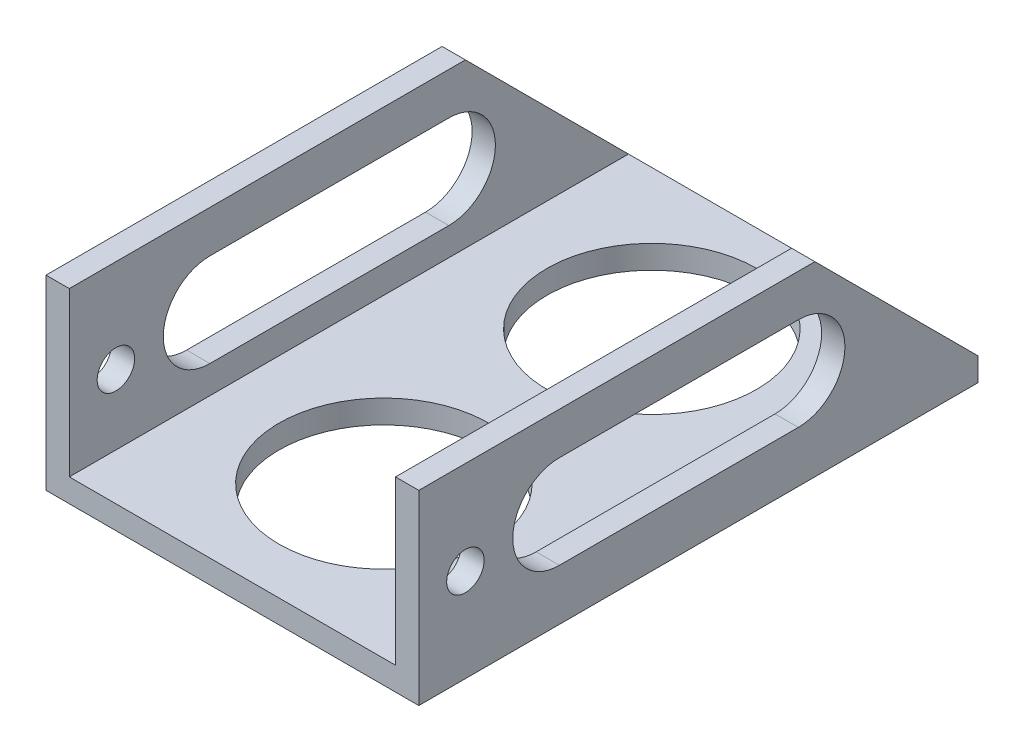
ISO-10303-21;
HEADER;
FILE_DESCRIPTION(('STEP AP214'),'2;1');
FILE_NAME('part.step','',(''),(''),'','','');
FILE_SCHEMA(('AUTOMOTIVE_DESIGN { 1 0 10303 214 1 1 1 1 }'));
ENDSEC;
DATA;
#1=APPLICATION_CONTEXT('core data for automotive mechanical design processes');
#2=APPLICATION_PROTOCOL_DEFINITION('international standard','automotive_design',2000,#1);
#3=PRODUCT_CONTEXT('',#1,'mechanical');
#4=PRODUCT('Part','Part','',(#3));
#5=PRODUCT_RELATED_PRODUCT_CATEGORY('part','',(#4));
#6=PRODUCT_DEFINITION_FORMATION('','',#4);
#7=PRODUCT_DEFINITION_CONTEXT('part definition',#1,'design');
#8=PRODUCT_DEFINITION('design','',#6,#7);
#9=PRODUCT_DEFINITION_SHAPE('','',#8);
#10=(LENGTH_UNIT() NAMED_UNIT(*) SI_UNIT(.MILLI.,.METRE.));
#11=(NAMED_UNIT(*) PLANE_ANGLE_UNIT() SI_UNIT($,.RADIAN.));
#12=(NAMED_UNIT(*) SI_UNIT($,.STERADIAN.) SOLID_ANGLE_UNIT());
#13=UNCERTAINTY_MEASURE_WITH_UNIT(LENGTH_MEASURE(1.E-05),#10,'distance_accuracy_value','');
#14=(GEOMETRIC_REPRESENTATION_CONTEXT(3) GLOBAL_UNCERTAINTY_ASSIGNED_CONTEXT((#13)) GLOBAL_UNIT_ASSIGNED_CONTEXT((#10,
#11,#12)) REPRESENTATION_CONTEXT('',''));
#15=CARTESIAN_POINT('',(0.,0.,0.));
#16=DIRECTION('',(0.,0.,1.));
#17=DIRECTION('',(1.,0.,0.));
#18=AXIS2_PLACEMENT_3D('',#15,#16,#17);
#19=CARTESIAN_POINT('',(0.,0.,76.2));
#20=DIRECTION('',(1.,0.,0.));
#21=DIRECTION('',(0.,0.,-1.));
#22=AXIS2_PLACEMENT_3D('',#19,#20,#21);
#23=PLANE('',#22);
#24=DIRECTION('',(0.,0.,1.));
#25=VECTOR('',#24,1.);
#26=CARTESIAN_POINT('',(0.,6.97375743317016,24.4858929425078));
#27=LINE('',#26,#25);
#28=CARTESIAN_POINT('',(0.,6.97375743317016,24.4858929425078));
#29=VERTEX_POINT('',#28);
#30=CARTESIAN_POINT('',(0.,6.97375743317016,57.0401023301699));
#31=VERTEX_POINT('',#30);
#32=EDGE_CURVE('E173',#29,#31,#27,.T.);
#33=ORIENTED_EDGE('',*,*,#32,.F.);
#34=CARTESIAN_POINT('',(0.,13.3237574331702,24.4858929425078));
#35=DIRECTION('',(-1.,0.,0.));
#36=DIRECTION('',(0.,0.,1.));
#37=AXIS2_PLACEMENT_3D('',#34,#35,#36);
#38=CIRCLE('',#37,6.35);
#39=CARTESIAN_POINT('',(0.,19.6737574331702,24.4858929425078));
#40=VERTEX_POINT('',#39);
#41=EDGE_CURVE('E52',#40,#29,#38,.T.);
#42=ORIENTED_EDGE('',*,*,#41,.F.);
#43=DIRECTION('',(0.,0.,-1.));
#44=VECTOR('',#43,1.);
#45=CARTESIAN_POINT('',(0.,19.6737574331702,24.4858929425078));
#46=LINE('',#45,#44);
#47=CARTESIAN_POINT('',(0.,19.6737574331702,57.0401023301699));
#48=VERTEX_POINT('',#47);
#49=EDGE_CURVE('E180',#48,#40,#46,.T.);
#50=ORIENTED_EDGE('',*,*,#49,.F.);
#51=CARTESIAN_POINT('',(0.,13.3237574331702,57.0401023301699));
#52=DIRECTION('',(-1.,0.,0.));
#53=DIRECTION('',(0.,0.,1.));
#54=AXIS2_PLACEMENT_3D('',#51,#52,#53);
#55=CIRCLE('',#54,6.35);
#56=EDGE_CURVE('E163',#31,#48,#55,.T.);
#57=ORIENTED_EDGE('',*,*,#56,.F.);
#58=EDGE_LOOP('',(#33,#42,#50,#57));
#59=FACE_BOUND('',#58,.T.);
#60=CARTESIAN_POINT('',(0.,12.7,69.85));
#61=DIRECTION('',(-1.,0.,0.));
#62=DIRECTION('',(0.,0.,1.));
#63=AXIS2_PLACEMENT_3D('',#60,#61,#62);
#64=CIRCLE('',#63,2.5527);
#65=CARTESIAN_POINT('',(0.,12.7,72.4027));
#66=VERTEX_POINT('',#65);
#67=EDGE_CURVE('E239',#66,#66,#64,.T.);
#68=ORIENTED_EDGE('',*,*,#67,.F.);
#69=EDGE_LOOP('',(#68));
#70=FACE_BOUND('',#69,.T.);
#71=DIRECTION('',(0.,0.,-1.));
#72=VECTOR('',#71,1.);
#73=CARTESIAN_POINT('',(0.,25.4,76.2));
#74=LINE('',#73,#72);
#75=CARTESIAN_POINT('',(0.,25.4,76.2));
#76=VERTEX_POINT('',#75);
#77=CARTESIAN_POINT('',(0.,25.4,22.2249999999997));
#78=VERTEX_POINT('',#77);
#79=EDGE_CURVE('E274',#76,#78,#74,.T.);
#80=ORIENTED_EDGE('',*,*,#79,.T.);
#81=DIRECTION('',(0.,0.707106781186552,0.707106781186543));
#82=VECTOR('',#81,1.);
#83=CARTESIAN_POINT('',(0.,3.175,0.));
#84=LINE('',#83,#82);
#85=CARTESIAN_POINT('',(0.,3.175,0.));
#86=VERTEX_POINT('',#85);
#87=EDGE_CURVE('E222',#86,#78,#84,.T.);
#88=ORIENTED_EDGE('',*,*,#87,.F.);
#89=DIRECTION('',(0.,-1.,0.));
#90=VECTOR('',#89,1.);
#91=CARTESIAN_POINT('',(0.,0.,0.));
#92=LINE('',#91,#90);
#93=CARTESIAN_POINT('',(0.,0.,0.));
#94=VERTEX_POINT('',#93);
#95=EDGE_CURVE('E255',#86,#94,#92,.T.);
#96=ORIENTED_EDGE('',*,*,#95,.T.);
#97=DIRECTION('',(0.,0.,-1.));
#98=VECTOR('',#97,1.);
#99=CARTESIAN_POINT('',(0.,0.,76.2));
#100=LINE('',#99,#98);
#101=CARTESIAN_POINT('',(0.,0.,76.2));
#102=VERTEX_POINT('',#101);
#103=EDGE_CURVE('E303',#102,#94,#100,.T.);
#104=ORIENTED_EDGE('',*,*,#103,.F.);
#105=DIRECTION('',(0.,-1.,0.));
#106=VECTOR('',#105,1.);
#107=CARTESIAN_POINT('',(0.,0.,76.2));
#108=LINE('',#107,#106);
#109=EDGE_CURVE('E256',#76,#102,#108,.T.);
#110=ORIENTED_EDGE('',*,*,#109,.F.);
#111=EDGE_LOOP('',(#80,#88,#96,#104,#110));
#112=FACE_BOUND('',#111,.T.);
#113=ADVANCED_FACE('F38',(#59,#70,#112),#23,.F.);
#114=CARTESIAN_POINT('',(0.,0.,76.2));
#115=DIRECTION('',(0.,1.,0.));
#116=DIRECTION('',(0.,0.,1.));
#117=AXIS2_PLACEMENT_3D('',#114,#115,#116);
#118=PLANE('',#117);
#119=CARTESIAN_POINT('',(25.4,0.,55.5625));
#120=DIRECTION('',(0.,1.,0.));
#121=DIRECTION('',(0.,0.,1.));
#122=AXIS2_PLACEMENT_3D('',#119,#120,#121);
#123=CIRCLE('',#122,14.2875);
#124=CARTESIAN_POINT('',(25.4,0.,69.85));
#125=VERTEX_POINT('',#124);
#126=EDGE_CURVE('E219',#125,#125,#123,.F.);
#127=ORIENTED_EDGE('',*,*,#126,.F.);
#128=EDGE_LOOP('',(#127));
#129=FACE_BOUND('',#128,.T.);
#130=CARTESIAN_POINT('',(25.4,0.,19.05));
#131=DIRECTION('',(0.,-1.,0.));
#132=DIRECTION('',(0.,0.,-1.));
#133=AXIS2_PLACEMENT_3D('',#130,#131,#132);
#134=CIRCLE('',#133,14.2875);
#135=CARTESIAN_POINT('',(25.4,0.,4.7625));
#136=VERTEX_POINT('',#135);
#137=EDGE_CURVE('E249',#136,#136,#134,.T.);
#138=ORIENTED_EDGE('',*,*,#137,.F.);
#139=EDGE_LOOP('',(#138));
#140=FACE_BOUND('',#139,.T.);
#141=DIRECTION('',(1.,0.,0.));
#142=VECTOR('',#141,1.);
#143=CARTESIAN_POINT('',(0.,0.,0.));
#144=LINE('',#143,#142);
#145=CARTESIAN_POINT('',(50.8,0.,0.));
#146=VERTEX_POINT('',#145);
#147=EDGE_CURVE('E276',#94,#146,#144,.T.);
#148=ORIENTED_EDGE('',*,*,#147,.T.);
#149=DIRECTION('',(0.,0.,-1.));
#150=VECTOR('',#149,1.);
#151=CARTESIAN_POINT('',(50.8,0.,76.2));
#152=LINE('',#151,#150);
#153=CARTESIAN_POINT('',(50.8,0.,76.2));
#154=VERTEX_POINT('',#153);
#155=EDGE_CURVE('E300',#154,#146,#152,.T.);
#156=ORIENTED_EDGE('',*,*,#155,.F.);
#157=DIRECTION('',(1.,0.,0.));
#158=VECTOR('',#157,1.);
#159=CARTESIAN_POINT('',(0.,0.,76.2));
#160=LINE('',#159,#158);
#161=EDGE_CURVE('E259',#102,#154,#160,.T.);
#162=ORIENTED_EDGE('',*,*,#161,.F.);
#163=ORIENTED_EDGE('',*,*,#103,.T.);
#164=EDGE_LOOP('',(#148,#156,#162,#163));
#165=FACE_BOUND('',#164,.T.);
#166=ADVANCED_FACE('F333',(#129,#140,#165),#118,.F.);
#167=CARTESIAN_POINT('',(50.8,0.,76.2));
#168=DIRECTION('',(-1.,0.,0.));
#169=DIRECTION('',(0.,0.,1.));
#170=AXIS2_PLACEMENT_3D('',#167,#168,#169);
#171=PLANE('',#170);
#172=DIRECTION('',(0.,0.,-1.));
#173=VECTOR('',#172,1.);
#174=CARTESIAN_POINT('',(50.8,19.6737574331702,24.4858929425078));
#175=LINE('',#174,#173);
#176=CARTESIAN_POINT('',(50.8,19.6737574331702,57.0401023301699));
#177=VERTEX_POINT('',#176);
#178=CARTESIAN_POINT('',(50.8,19.6737574331702,24.4858929425078));
#179=VERTEX_POINT('',#178);
#180=EDGE_CURVE('E192',#177,#179,#175,.T.);
#181=ORIENTED_EDGE('',*,*,#180,.T.);
#182=CARTESIAN_POINT('',(50.8,13.3237574331702,24.4858929425078));
#183=DIRECTION('',(-1.,0.,0.));
#184=DIRECTION('',(0.,0.,1.));
#185=AXIS2_PLACEMENT_3D('',#182,#183,#184);
#186=CIRCLE('',#185,6.35);
#187=CARTESIAN_POINT('',(50.8,6.97375743317016,24.4858929425078));
#188=VERTEX_POINT('',#187);
#189=EDGE_CURVE('E182',#179,#188,#186,.T.);
#190=ORIENTED_EDGE('',*,*,#189,.T.);
#191=DIRECTION('',(0.,0.,1.));
#192=VECTOR('',#191,1.);
#193=CARTESIAN_POINT('',(50.8,6.97375743317016,24.4858929425078));
#194=LINE('',#193,#192);
#195=CARTESIAN_POINT('',(50.8,6.97375743317016,57.0401023301699));
#196=VERTEX_POINT('',#195);
#197=EDGE_CURVE('E188',#188,#196,#194,.T.);
#198=ORIENTED_EDGE('',*,*,#197,.T.);
#199=CARTESIAN_POINT('',(50.8,13.3237574331702,57.0401023301699));
#200=DIRECTION('',(-1.,0.,0.));
#201=DIRECTION('',(0.,0.,1.));
#202=AXIS2_PLACEMENT_3D('',#199,#200,#201);
#203=CIRCLE('',#202,6.35);
#204=EDGE_CURVE('E60',#196,#177,#203,.T.);
#205=ORIENTED_EDGE('',*,*,#204,.T.);
#206=EDGE_LOOP('',(#181,#190,#198,#205));
#207=FACE_BOUND('',#206,.T.);
#208=CARTESIAN_POINT('',(50.8,12.7,69.85));
#209=DIRECTION('',(-1.,0.,0.));
#210=DIRECTION('',(0.,0.,1.));
#211=AXIS2_PLACEMENT_3D('',#208,#209,#210);
#212=CIRCLE('',#211,2.5527);
#213=CARTESIAN_POINT('',(50.8,12.7,72.4027));
#214=VERTEX_POINT('',#213);
#215=EDGE_CURVE('E240',#214,#214,#212,.T.);
#216=ORIENTED_EDGE('',*,*,#215,.T.);
#217=EDGE_LOOP('',(#216));
#218=FACE_BOUND('',#217,.T.);
#219=DIRECTION('',(0.,1.,0.));
#220=VECTOR('',#219,1.);
#221=CARTESIAN_POINT('',(50.8,0.,0.));
#222=LINE('',#221,#220);
#223=CARTESIAN_POINT('',(50.8,3.175,0.));
#224=VERTEX_POINT('',#223);
#225=EDGE_CURVE('E278',#146,#224,#222,.T.);
#226=ORIENTED_EDGE('',*,*,#225,.T.);
#227=DIRECTION('',(0.,0.707106781186552,0.707106781186543));
#228=VECTOR('',#227,1.);
#229=CARTESIAN_POINT('',(50.8,3.175,0.));
#230=LINE('',#229,#228);
#231=CARTESIAN_POINT('',(50.8,25.4,22.2249999999997));
#232=VERTEX_POINT('',#231);
#233=EDGE_CURVE('E224',#224,#232,#230,.T.);
#234=ORIENTED_EDGE('',*,*,#233,.T.);
#235=DIRECTION('',(0.,0.,-1.));
#236=VECTOR('',#235,1.);
#237=CARTESIAN_POINT('',(50.8,25.4,76.2));
#238=LINE('',#237,#236);
#239=CARTESIAN_POINT('',(50.8,25.4,76.2));
#240=VERTEX_POINT('',#239);
#241=EDGE_CURVE('E297',#240,#232,#238,.T.);
#242=ORIENTED_EDGE('',*,*,#241,.F.);
#243=DIRECTION('',(0.,1.,0.));
#244=VECTOR('',#243,1.);
#245=CARTESIAN_POINT('',(50.8,0.,76.2));
#246=LINE('',#245,#244);
#247=EDGE_CURVE('E262',#154,#240,#246,.T.);
#248=ORIENTED_EDGE('',*,*,#247,.F.);
#249=ORIENTED_EDGE('',*,*,#155,.T.);
#250=EDGE_LOOP('',(#226,#234,#242,#248,#249));
#251=FACE_BOUND('',#250,.T.);
#252=ADVANCED_FACE('F337',(#207,#218,#251),#171,.F.);
#253=CARTESIAN_POINT('',(50.8,25.4,76.2));
#254=DIRECTION('',(0.,-1.,0.));
#255=DIRECTION('',(0.,0.,-1.));
#256=AXIS2_PLACEMENT_3D('',#253,#254,#255);
#257=PLANE('',#256);
#258=ORIENTED_EDGE('',*,*,#241,.T.);
#259=DIRECTION('',(-1.,0.,0.));
#260=VECTOR('',#259,1.);
#261=CARTESIAN_POINT('',(50.8,25.4,22.2249999999997));
#262=LINE('',#261,#260);
#263=CARTESIAN_POINT('',(47.625,25.4,22.2249999999997));
#264=VERTEX_POINT('',#263);
#265=EDGE_CURVE('E228',#232,#264,#262,.T.);
#266=ORIENTED_EDGE('',*,*,#265,.T.);
#267=DIRECTION('',(0.,0.,-1.));
#268=VECTOR('',#267,1.);
#269=CARTESIAN_POINT('',(47.625,25.4,76.2));
#270=LINE('',#269,#268);
#271=CARTESIAN_POINT('',(47.625,25.4,76.2));
#272=VERTEX_POINT('',#271);
#273=EDGE_CURVE('E294',#272,#264,#270,.T.);
#274=ORIENTED_EDGE('',*,*,#273,.F.);
#275=DIRECTION('',(-1.,0.,0.));
#276=VECTOR('',#275,1.);
#277=CARTESIAN_POINT('',(50.8,25.4,76.2));
#278=LINE('',#277,#276);
#279=EDGE_CURVE('E264',#240,#272,#278,.T.);
#280=ORIENTED_EDGE('',*,*,#279,.F.);
#281=EDGE_LOOP('',(#258,#266,#274,#280));
#282=FACE_BOUND('',#281,.T.);
#283=ADVANCED_FACE('F342',(#282),#257,.F.);
#284=CARTESIAN_POINT('',(47.625,3.175,76.2));
#285=DIRECTION('',(1.,0.,0.));
#286=DIRECTION('',(0.,0.,-1.));
#287=AXIS2_PLACEMENT_3D('',#284,#285,#286);
#288=PLANE('',#287);
#289=DIRECTION('',(0.,0.,-1.));
#290=VECTOR('',#289,1.);
#291=CARTESIAN_POINT('',(47.625,6.97375743317016,76.2));
#292=LINE('',#291,#290);
#293=CARTESIAN_POINT('',(47.625,6.97375743317016,57.0401023301699));
#294=VERTEX_POINT('',#293);
#295=CARTESIAN_POINT('',(47.625,6.97375743317016,24.4858929425078));
#296=VERTEX_POINT('',#295);
#297=EDGE_CURVE('E198',#294,#296,#292,.T.);
#298=ORIENTED_EDGE('',*,*,#297,.T.);
#299=CARTESIAN_POINT('',(47.625,13.3237574331702,24.4858929425078));
#300=DIRECTION('',(1.,0.,0.));
#301=DIRECTION('',(0.,0.,-1.));
#302=AXIS2_PLACEMENT_3D('',#299,#300,#301);
#303=CIRCLE('',#302,6.35);
#304=CARTESIAN_POINT('',(47.625,19.6737574331702,24.4858929425078));
#305=VERTEX_POINT('',#304);
#306=EDGE_CURVE('E213',#296,#305,#303,.T.);
#307=ORIENTED_EDGE('',*,*,#306,.T.);
#308=DIRECTION('',(0.,0.,1.));
#309=VECTOR('',#308,1.);
#310=CARTESIAN_POINT('',(47.625,19.6737574331702,76.2));
#311=LINE('',#310,#309);
#312=CARTESIAN_POINT('',(47.625,19.6737574331702,57.0401023301699));
#313=VERTEX_POINT('',#312);
#314=EDGE_CURVE('E210',#305,#313,#311,.T.);
#315=ORIENTED_EDGE('',*,*,#314,.T.);
#316=CARTESIAN_POINT('',(47.625,13.3237574331702,57.0401023301699));
#317=DIRECTION('',(1.,0.,0.));
#318=DIRECTION('',(0.,0.,-1.));
#319=AXIS2_PLACEMENT_3D('',#316,#317,#318);
#320=CIRCLE('',#319,6.35);
#321=EDGE_CURVE('E207',#313,#294,#320,.T.);
#322=ORIENTED_EDGE('',*,*,#321,.T.);
#323=EDGE_LOOP('',(#298,#307,#315,#322));
#324=FACE_BOUND('',#323,.T.);
#325=CARTESIAN_POINT('',(47.625,12.7,69.85));
#326=DIRECTION('',(1.,0.,0.));
#327=DIRECTION('',(0.,0.,-1.));
#328=AXIS2_PLACEMENT_3D('',#325,#326,#327);
#329=CIRCLE('',#328,2.5527);
#330=CARTESIAN_POINT('',(47.625,12.7,67.2973));
#331=VERTEX_POINT('',#330);
#332=EDGE_CURVE('E246',#331,#331,#329,.T.);
#333=ORIENTED_EDGE('',*,*,#332,.T.);
#334=EDGE_LOOP('',(#333));
#335=FACE_BOUND('',#334,.T.);
#336=ORIENTED_EDGE('',*,*,#273,.T.);
#337=DIRECTION('',(0.,-0.707106781186552,-0.707106781186543));
#338=VECTOR('',#337,1.);
#339=CARTESIAN_POINT('',(47.625,41.275,38.0999999999996));
#340=LINE('',#339,#338);
#341=CARTESIAN_POINT('',(47.625,3.175,0.));
#342=VERTEX_POINT('',#341);
#343=EDGE_CURVE('E236',#264,#342,#340,.T.);
#344=ORIENTED_EDGE('',*,*,#343,.T.);
#345=DIRECTION('',(0.,0.,-1.));
#346=VECTOR('',#345,1.);
#347=CARTESIAN_POINT('',(47.625,3.175,76.2));
#348=LINE('',#347,#346);
#349=CARTESIAN_POINT('',(47.625,3.175,76.2));
#350=VERTEX_POINT('',#349);
#351=EDGE_CURVE('E291',#350,#342,#348,.T.);
#352=ORIENTED_EDGE('',*,*,#351,.F.);
#353=DIRECTION('',(0.,-1.,0.));
#354=VECTOR('',#353,1.);
#355=CARTESIAN_POINT('',(47.625,3.175,76.2));
#356=LINE('',#355,#354);
#357=EDGE_CURVE('E266',#272,#350,#356,.T.);
#358=ORIENTED_EDGE('',*,*,#357,.F.);
#359=EDGE_LOOP('',(#336,#344,#352,#358));
#360=FACE_BOUND('',#359,.T.);
#361=ADVANCED_FACE('F350',(#324,#335,#360),#288,.F.);
#362=CARTESIAN_POINT('',(3.175,3.175,76.2));
#363=DIRECTION('',(0.,-1.,0.));
#364=DIRECTION('',(0.,0.,-1.));
#365=AXIS2_PLACEMENT_3D('',#362,#363,#364);
#366=PLANE('',#365);
#367=CARTESIAN_POINT('',(25.4,3.175,55.5625));
#368=DIRECTION('',(0.,1.,0.));
#369=DIRECTION('',(0.,0.,1.));
#370=AXIS2_PLACEMENT_3D('',#367,#368,#369);
#371=CIRCLE('',#370,14.2875);
#372=CARTESIAN_POINT('',(25.4,3.175,69.85));
#373=VERTEX_POINT('',#372);
#374=EDGE_CURVE('E216',#373,#373,#371,.T.);
#375=ORIENTED_EDGE('',*,*,#374,.F.);
#376=EDGE_LOOP('',(#375));
#377=FACE_BOUND('',#376,.T.);
#378=CARTESIAN_POINT('',(25.4,3.175,19.05));
#379=DIRECTION('',(0.,-1.,0.));
#380=DIRECTION('',(0.,0.,-1.));
#381=AXIS2_PLACEMENT_3D('',#378,#379,#380);
#382=CIRCLE('',#381,14.2875);
#383=CARTESIAN_POINT('',(25.4,3.175,4.7625));
#384=VERTEX_POINT('',#383);
#385=EDGE_CURVE('E252',#384,#384,#382,.F.);
#386=ORIENTED_EDGE('',*,*,#385,.F.);
#387=EDGE_LOOP('',(#386));
#388=FACE_BOUND('',#387,.T.);
#389=DIRECTION('',(-1.,0.,0.));
#390=VECTOR('',#389,1.);
#391=CARTESIAN_POINT('',(3.175,3.175,0.));
#392=LINE('',#391,#390);
#393=CARTESIAN_POINT('',(3.175,3.175,0.));
#394=VERTEX_POINT('',#393);
#395=EDGE_CURVE('E260',#342,#394,#392,.T.);
#396=ORIENTED_EDGE('',*,*,#395,.T.);
#397=DIRECTION('',(0.,0.,-1.));
#398=VECTOR('',#397,1.);
#399=CARTESIAN_POINT('',(3.175,3.175,76.2));
#400=LINE('',#399,#398);
#401=CARTESIAN_POINT('',(3.175,3.175,76.2));
#402=VERTEX_POINT('',#401);
#403=EDGE_CURVE('E288',#402,#394,#400,.T.);
#404=ORIENTED_EDGE('',*,*,#403,.F.);
#405=DIRECTION('',(-1.,0.,0.));
#406=VECTOR('',#405,1.);
#407=CARTESIAN_POINT('',(3.175,3.175,76.2));
#408=LINE('',#407,#406);
#409=EDGE_CURVE('E268',#350,#402,#408,.T.);
#410=ORIENTED_EDGE('',*,*,#409,.F.);
#411=ORIENTED_EDGE('',*,*,#351,.T.);
#412=EDGE_LOOP('',(#396,#404,#410,#411));
#413=FACE_BOUND('',#412,.T.);
#414=ADVANCED_FACE('F354',(#377,#388,#413),#366,.F.);
#415=CARTESIAN_POINT('',(3.175,3.175,76.2));
#416=DIRECTION('',(-1.,0.,0.));
#417=DIRECTION('',(0.,0.,1.));
#418=AXIS2_PLACEMENT_3D('',#415,#416,#417);
#419=PLANE('',#418);
#420=DIRECTION('',(0.,0.,-1.));
#421=VECTOR('',#420,1.);
#422=CARTESIAN_POINT('',(3.175,19.6737574331702,76.2));
#423=LINE('',#422,#421);
#424=CARTESIAN_POINT('',(3.175,19.6737574331702,57.0401023301699));
#425=VERTEX_POINT('',#424);
#426=CARTESIAN_POINT('',(3.175,19.6737574331702,24.4858929425078));
#427=VERTEX_POINT('',#426);
#428=EDGE_CURVE('E45',#425,#427,#423,.T.);
#429=ORIENTED_EDGE('',*,*,#428,.T.);
#430=CARTESIAN_POINT('',(3.175,13.3237574331702,24.4858929425078));
#431=DIRECTION('',(-1.,0.,0.));
#432=DIRECTION('',(0.,0.,1.));
#433=AXIS2_PLACEMENT_3D('',#430,#431,#432);
#434=CIRCLE('',#433,6.35);
#435=CARTESIAN_POINT('',(3.175,6.97375743317016,24.4858929425078));
#436=VERTEX_POINT('',#435);
#437=EDGE_CURVE('E11',#427,#436,#434,.T.);
#438=ORIENTED_EDGE('',*,*,#437,.T.);
#439=DIRECTION('',(0.,0.,1.));
#440=VECTOR('',#439,1.);
#441=CARTESIAN_POINT('',(3.175,6.97375743317016,76.2));
#442=LINE('',#441,#440);
#443=CARTESIAN_POINT('',(3.175,6.97375743317016,57.0401023301699));
#444=VERTEX_POINT('',#443);
#445=EDGE_CURVE('E310',#436,#444,#442,.T.);
#446=ORIENTED_EDGE('',*,*,#445,.T.);
#447=CARTESIAN_POINT('',(3.175,13.3237574331702,57.0401023301699));
#448=DIRECTION('',(-1.,0.,0.));
#449=DIRECTION('',(0.,0.,1.));
#450=AXIS2_PLACEMENT_3D('',#447,#448,#449);
#451=CIRCLE('',#450,6.35);
#452=EDGE_CURVE('E166',#444,#425,#451,.T.);
#453=ORIENTED_EDGE('',*,*,#452,.T.);
#454=EDGE_LOOP('',(#429,#438,#446,#453));
#455=FACE_BOUND('',#454,.T.);
#456=CARTESIAN_POINT('',(3.175,12.7,69.85));
#457=DIRECTION('',(-1.,0.,0.));
#458=DIRECTION('',(0.,0.,1.));
#459=AXIS2_PLACEMENT_3D('',#456,#457,#458);
#460=CIRCLE('',#459,2.5527);
#461=CARTESIAN_POINT('',(3.175,12.7,72.4027));
#462=VERTEX_POINT('',#461);
#463=EDGE_CURVE('E243',#462,#462,#460,.T.);
#464=ORIENTED_EDGE('',*,*,#463,.T.);
#465=EDGE_LOOP('',(#464));
#466=FACE_BOUND('',#465,.T.);
#467=ORIENTED_EDGE('',*,*,#403,.T.);
#468=DIRECTION('',(0.,0.707106781186552,0.707106781186543));
#469=VECTOR('',#468,1.);
#470=CARTESIAN_POINT('',(3.175,41.275,38.0999999999996));
#471=LINE('',#470,#469);
#472=CARTESIAN_POINT('',(3.175,25.4,22.2249999999997));
#473=VERTEX_POINT('',#472);
#474=EDGE_CURVE('E231',#394,#473,#471,.T.);
#475=ORIENTED_EDGE('',*,*,#474,.T.);
#476=DIRECTION('',(0.,0.,-1.));
#477=VECTOR('',#476,1.);
#478=CARTESIAN_POINT('',(3.175,25.4,76.2));
#479=LINE('',#478,#477);
#480=CARTESIAN_POINT('',(3.175,25.4,76.2));
#481=VERTEX_POINT('',#480);
#482=EDGE_CURVE('E285',#481,#473,#479,.T.);
#483=ORIENTED_EDGE('',*,*,#482,.F.);
#484=DIRECTION('',(0.,1.,0.));
#485=VECTOR('',#484,1.);
#486=CARTESIAN_POINT('',(3.175,3.175,76.2));
#487=LINE('',#486,#485);
#488=EDGE_CURVE('E270',#402,#481,#487,.T.);
#489=ORIENTED_EDGE('',*,*,#488,.F.);
#490=EDGE_LOOP('',(#467,#475,#483,#489));
#491=FACE_BOUND('',#490,.T.);
#492=ADVANCED_FACE('F314',(#455,#466,#491),#419,.F.);
#493=CARTESIAN_POINT('',(0.,25.4,76.2));
#494=DIRECTION('',(0.,-1.,0.));
#495=DIRECTION('',(0.,0.,-1.));
#496=AXIS2_PLACEMENT_3D('',#493,#494,#495);
#497=PLANE('',#496);
#498=ORIENTED_EDGE('',*,*,#482,.T.);
#499=EDGE_CURVE('E232',#473,#78,#262,.T.);
#500=ORIENTED_EDGE('',*,*,#499,.T.);
#501=ORIENTED_EDGE('',*,*,#79,.F.);
#502=DIRECTION('',(-1.,0.,0.));
#503=VECTOR('',#502,1.);
#504=CARTESIAN_POINT('',(0.,25.4,76.2));
#505=LINE('',#504,#503);
#506=EDGE_CURVE('E272',#481,#76,#505,.T.);
#507=ORIENTED_EDGE('',*,*,#506,.F.);
#508=EDGE_LOOP('',(#498,#500,#501,#507));
#509=FACE_BOUND('',#508,.T.);
#510=ADVANCED_FACE('F361',(#509),#497,.F.);
#511=CARTESIAN_POINT('',(0.,0.,76.2));
#512=DIRECTION('',(0.,0.,-1.));
#513=DIRECTION('',(-1.,0.,0.));
#514=AXIS2_PLACEMENT_3D('',#511,#512,#513);
#515=PLANE('',#514);
#516=ORIENTED_EDGE('',*,*,#109,.T.);
#517=ORIENTED_EDGE('',*,*,#161,.T.);
#518=ORIENTED_EDGE('',*,*,#247,.T.);
#519=ORIENTED_EDGE('',*,*,#279,.T.);
#520=ORIENTED_EDGE('',*,*,#357,.T.);
#521=ORIENTED_EDGE('',*,*,#409,.T.);
#522=ORIENTED_EDGE('',*,*,#488,.T.);
#523=ORIENTED_EDGE('',*,*,#506,.T.);
#524=EDGE_LOOP('',(#516,#517,#518,#519,#520,#521,#522,#523));
#525=FACE_BOUND('',#524,.T.);
#526=ADVANCED_FACE('F364',(#525),#515,.F.);
#527=CARTESIAN_POINT('',(0.,0.,0.));
#528=DIRECTION('',(0.,0.,-1.));
#529=DIRECTION('',(-1.,0.,0.));
#530=AXIS2_PLACEMENT_3D('',#527,#528,#529);
#531=PLANE('',#530);
#532=DIRECTION('',(-1.,0.,0.));
#533=VECTOR('',#532,1.);
#534=CARTESIAN_POINT('',(50.8,3.175,0.));
#535=LINE('',#534,#533);
#536=EDGE_CURVE('E227',#224,#342,#535,.T.);
#537=ORIENTED_EDGE('',*,*,#536,.F.);
#538=ORIENTED_EDGE('',*,*,#225,.F.);
#539=ORIENTED_EDGE('',*,*,#147,.F.);
#540=ORIENTED_EDGE('',*,*,#95,.F.);
#541=DIRECTION('',(-1.,0.,0.));
#542=VECTOR('',#541,1.);
#543=CARTESIAN_POINT('',(0.,3.175,0.));
#544=LINE('',#543,#542);
#545=EDGE_CURVE('E306',#394,#86,#544,.T.);
#546=ORIENTED_EDGE('',*,*,#545,.F.);
#547=ORIENTED_EDGE('',*,*,#395,.F.);
#548=EDGE_LOOP('',(#537,#538,#539,#540,#546,#547));
#549=FACE_BOUND('',#548,.T.);
#550=ADVANCED_FACE('F366',(#549),#531,.T.);
#551=CARTESIAN_POINT('',(25.4,25.401,19.05));
#552=DIRECTION('',(0.,-1.,0.));
#553=DIRECTION('',(0.,0.,-1.));
#554=AXIS2_PLACEMENT_3D('',#551,#552,#553);
#555=CYLINDRICAL_SURFACE('',#554,14.2875);
#556=ORIENTED_EDGE('',*,*,#137,.T.);
#557=EDGE_LOOP('',(#556));
#558=FACE_BOUND('',#557,.T.);
#559=ORIENTED_EDGE('',*,*,#385,.T.);
#560=EDGE_LOOP('',(#559));
#561=FACE_BOUND('',#560,.T.);
#562=ADVANCED_FACE('F369',(#558,#561),#555,.F.);
#563=CARTESIAN_POINT('',(50.8,12.7,69.85));
#564=DIRECTION('',(-1.,0.,0.));
#565=DIRECTION('',(0.,0.,1.));
#566=AXIS2_PLACEMENT_3D('',#563,#564,#565);
#567=CYLINDRICAL_SURFACE('',#566,2.5527);
#568=ORIENTED_EDGE('',*,*,#67,.T.);
#569=EDGE_LOOP('',(#568));
#570=FACE_BOUND('',#569,.T.);
#571=ORIENTED_EDGE('',*,*,#463,.F.);
#572=EDGE_LOOP('',(#571));
#573=FACE_BOUND('',#572,.T.);
#574=ADVANCED_FACE('F376',(#570,#573),#567,.F.);
#575=ORIENTED_EDGE('',*,*,#215,.F.);
#576=EDGE_LOOP('',(#575));
#577=FACE_BOUND('',#576,.T.);
#578=ORIENTED_EDGE('',*,*,#332,.F.);
#579=EDGE_LOOP('',(#578));
#580=FACE_BOUND('',#579,.T.);
#581=ADVANCED_FACE('F378',(#577,#580),#567,.F.);
#582=CARTESIAN_POINT('',(50.8,3.175,0.));
#583=DIRECTION('',(0.,-0.707106781186543,0.707106781186552));
#584=DIRECTION('',(0.,-0.707106781186552,-0.707106781186543));
#585=AXIS2_PLACEMENT_3D('',#582,#583,#584);
#586=PLANE('',#585);
#587=ORIENTED_EDGE('',*,*,#545,.T.);
#588=ORIENTED_EDGE('',*,*,#87,.T.);
#589=ORIENTED_EDGE('',*,*,#499,.F.);
#590=ORIENTED_EDGE('',*,*,#474,.F.);
#591=EDGE_LOOP('',(#587,#588,#589,#590));
#592=FACE_BOUND('',#591,.T.);
#593=ADVANCED_FACE('F381',(#592),#586,.F.);
#594=ORIENTED_EDGE('',*,*,#265,.F.);
#595=ORIENTED_EDGE('',*,*,#233,.F.);
#596=ORIENTED_EDGE('',*,*,#536,.T.);
#597=ORIENTED_EDGE('',*,*,#343,.F.);
#598=EDGE_LOOP('',(#594,#595,#596,#597));
#599=FACE_BOUND('',#598,.T.);
#600=ADVANCED_FACE('F383',(#599),#586,.F.);
#601=CARTESIAN_POINT('',(25.4,-0.00100000000000013,55.5625));
#602=DIRECTION('',(0.,1.,0.));
#603=DIRECTION('',(0.,0.,1.));
#604=AXIS2_PLACEMENT_3D('',#601,#602,#603);
#605=CYLINDRICAL_SURFACE('',#604,14.2875);
#606=ORIENTED_EDGE('',*,*,#374,.T.);
#607=EDGE_LOOP('',(#606));
#608=FACE_BOUND('',#607,.T.);
#609=ORIENTED_EDGE('',*,*,#126,.T.);
#610=EDGE_LOOP('',(#609));
#611=FACE_BOUND('',#610,.T.);
#612=ADVANCED_FACE('F385',(#608,#611),#605,.F.);
#613=CARTESIAN_POINT('',(50.8,6.97375743317016,24.4858929425078));
#614=DIRECTION('',(0.,-1.,0.));
#615=DIRECTION('',(0.,0.,-1.));
#616=AXIS2_PLACEMENT_3D('',#613,#614,#615);
#617=PLANE('',#616);
#618=DIRECTION('',(-1.,0.,0.));
#619=VECTOR('',#618,1.);
#620=CARTESIAN_POINT('',(50.8,6.97375743317016,24.4858929425078));
#621=LINE('',#620,#619);
#622=EDGE_CURVE('E175',#436,#29,#621,.T.);
#623=ORIENTED_EDGE('',*,*,#622,.T.);
#624=ORIENTED_EDGE('',*,*,#32,.T.);
#625=DIRECTION('',(-1.,0.,0.));
#626=VECTOR('',#625,1.);
#627=CARTESIAN_POINT('',(50.8,6.97375743317016,57.0401023301699));
#628=LINE('',#627,#626);
#629=EDGE_CURVE('E158',#444,#31,#628,.T.);
#630=ORIENTED_EDGE('',*,*,#629,.F.);
#631=ORIENTED_EDGE('',*,*,#445,.F.);
#632=EDGE_LOOP('',(#623,#624,#630,#631));
#633=FACE_BOUND('',#632,.T.);
#634=ADVANCED_FACE('F174',(#633),#617,.F.);
#635=CARTESIAN_POINT('',(50.8,13.3237574331702,57.0401023301699));
#636=DIRECTION('',(-1.,0.,0.));
#637=DIRECTION('',(0.,0.,1.));
#638=AXIS2_PLACEMENT_3D('',#635,#636,#637);
#639=CYLINDRICAL_SURFACE('',#638,6.35);
#640=ORIENTED_EDGE('',*,*,#629,.T.);
#641=ORIENTED_EDGE('',*,*,#56,.T.);
#642=DIRECTION('',(-1.,0.,0.));
#643=VECTOR('',#642,1.);
#644=CARTESIAN_POINT('',(50.8,19.6737574331702,57.0401023301699));
#645=LINE('',#644,#643);
#646=EDGE_CURVE('E202',#425,#48,#645,.T.);
#647=ORIENTED_EDGE('',*,*,#646,.F.);
#648=ORIENTED_EDGE('',*,*,#452,.F.);
#649=EDGE_LOOP('',(#640,#641,#647,#648));
#650=FACE_BOUND('',#649,.T.);
#651=ADVANCED_FACE('F160',(#650),#639,.F.);
#652=CARTESIAN_POINT('',(50.8,19.6737574331702,24.4858929425078));
#653=DIRECTION('',(0.,1.,0.));
#654=DIRECTION('',(0.,0.,1.));
#655=AXIS2_PLACEMENT_3D('',#652,#653,#654);
#656=PLANE('',#655);
#657=ORIENTED_EDGE('',*,*,#646,.T.);
#658=ORIENTED_EDGE('',*,*,#49,.T.);
#659=DIRECTION('',(-1.,0.,0.));
#660=VECTOR('',#659,1.);
#661=CARTESIAN_POINT('',(50.8,19.6737574331702,24.4858929425078));
#662=LINE('',#661,#660);
#663=EDGE_CURVE('E199',#427,#40,#662,.T.);
#664=ORIENTED_EDGE('',*,*,#663,.F.);
#665=ORIENTED_EDGE('',*,*,#428,.F.);
#666=EDGE_LOOP('',(#657,#658,#664,#665));
#667=FACE_BOUND('',#666,.T.);
#668=ADVANCED_FACE('F318',(#667),#656,.F.);
#669=CARTESIAN_POINT('',(50.8,13.3237574331702,24.4858929425078));
#670=DIRECTION('',(-1.,0.,0.));
#671=DIRECTION('',(0.,0.,1.));
#672=AXIS2_PLACEMENT_3D('',#669,#670,#671);
#673=CYLINDRICAL_SURFACE('',#672,6.35);
#674=ORIENTED_EDGE('',*,*,#663,.T.);
#675=ORIENTED_EDGE('',*,*,#41,.T.);
#676=ORIENTED_EDGE('',*,*,#622,.F.);
#677=ORIENTED_EDGE('',*,*,#437,.F.);
#678=EDGE_LOOP('',(#674,#675,#676,#677));
#679=FACE_BOUND('',#678,.T.);
#680=ADVANCED_FACE('F319',(#679),#673,.F.);
#681=EDGE_CURVE('E170',#188,#296,#621,.T.);
#682=ORIENTED_EDGE('',*,*,#681,.F.);
#683=ORIENTED_EDGE('',*,*,#189,.F.);
#684=EDGE_CURVE('E195',#179,#305,#662,.T.);
#685=ORIENTED_EDGE('',*,*,#684,.T.);
#686=ORIENTED_EDGE('',*,*,#306,.F.);
#687=EDGE_LOOP('',(#682,#683,#685,#686));
#688=FACE_BOUND('',#687,.T.);
#689=ADVANCED_FACE('F321',(#688),#673,.F.);
#690=ORIENTED_EDGE('',*,*,#684,.F.);
#691=ORIENTED_EDGE('',*,*,#180,.F.);
#692=EDGE_CURVE('E200',#177,#313,#645,.T.);
#693=ORIENTED_EDGE('',*,*,#692,.T.);
#694=ORIENTED_EDGE('',*,*,#314,.F.);
#695=EDGE_LOOP('',(#690,#691,#693,#694));
#696=FACE_BOUND('',#695,.T.);
#697=ADVANCED_FACE('F327',(#696),#656,.F.);
#698=ORIENTED_EDGE('',*,*,#692,.F.);
#699=ORIENTED_EDGE('',*,*,#204,.F.);
#700=EDGE_CURVE('E169',#196,#294,#628,.T.);
#701=ORIENTED_EDGE('',*,*,#700,.T.);
#702=ORIENTED_EDGE('',*,*,#321,.F.);
#703=EDGE_LOOP('',(#698,#699,#701,#702));
#704=FACE_BOUND('',#703,.T.);
#705=ADVANCED_FACE('F492',(#704),#639,.F.);
#706=ORIENTED_EDGE('',*,*,#700,.F.);
#707=ORIENTED_EDGE('',*,*,#197,.F.);
#708=ORIENTED_EDGE('',*,*,#681,.T.);
#709=ORIENTED_EDGE('',*,*,#297,.F.);
#710=EDGE_LOOP('',(#706,#707,#708,#709));
#711=FACE_BOUND('',#710,.T.);
#712=ADVANCED_FACE('F392',(#711),#617,.F.);
#713=CLOSED_SHELL('',(#113,#166,#252,#283,#361,#414,#492,#510,#526,#550,#562,#574,#581,#593,
#600,#612,#634,#651,#668,#680,#689,#697,#705,#712));
#714=MANIFOLD_SOLID_BREP('B2',#713);
#715=ADVANCED_BREP_SHAPE_REPRESENTATION('',(#18,#714),#14);
#716=SHAPE_DEFINITION_REPRESENTATION(#9,#715);
ENDSEC;
END-ISO-10303-21;
